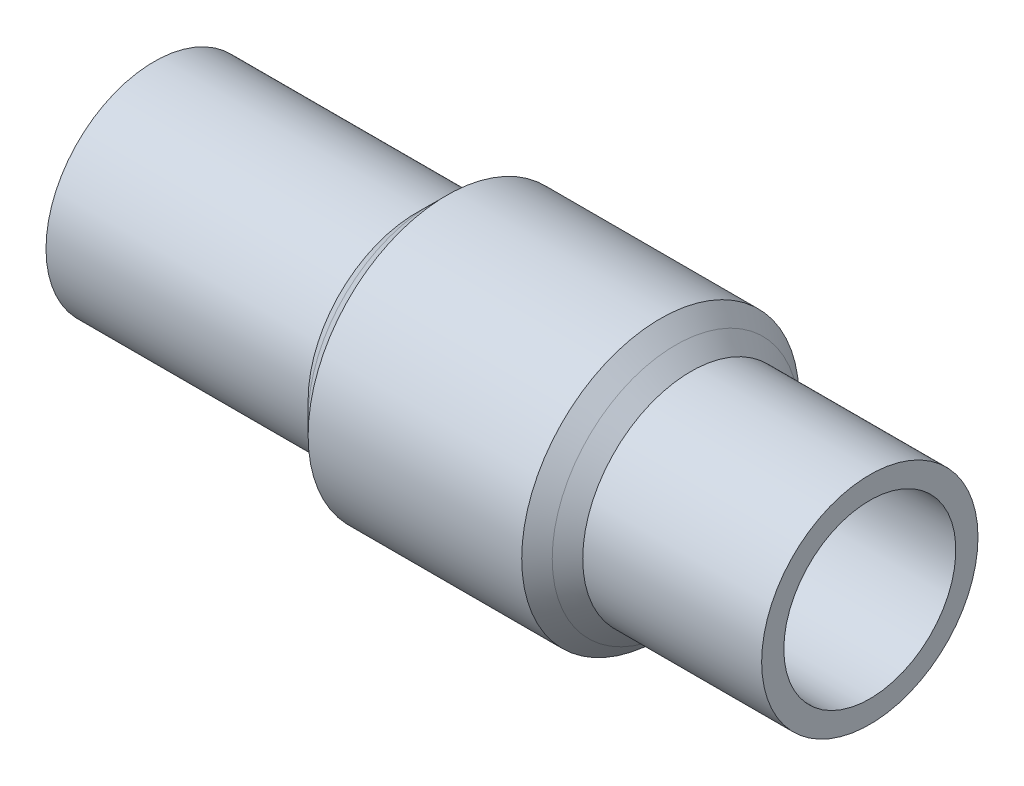
ISO-10303-21;
HEADER;
FILE_DESCRIPTION(('STEP AP214'),'2;1');
FILE_NAME('part.step','',(''),(''),'','','');
FILE_SCHEMA(('AUTOMOTIVE_DESIGN { 1 0 10303 214 1 1 1 1 }'));
ENDSEC;
DATA;
#1=APPLICATION_CONTEXT('core data for automotive mechanical design processes');
#2=APPLICATION_PROTOCOL_DEFINITION('international standard','automotive_design',2000,#1);
#3=PRODUCT_CONTEXT('',#1,'mechanical');
#4=PRODUCT('Part','Part','',(#3));
#5=PRODUCT_RELATED_PRODUCT_CATEGORY('part','',(#4));
#6=PRODUCT_DEFINITION_FORMATION('','',#4);
#7=PRODUCT_DEFINITION_CONTEXT('part definition',#1,'design');
#8=PRODUCT_DEFINITION('design','',#6,#7);
#9=PRODUCT_DEFINITION_SHAPE('','',#8);
#10=(LENGTH_UNIT() NAMED_UNIT(*) SI_UNIT(.MILLI.,.METRE.));
#11=(NAMED_UNIT(*) PLANE_ANGLE_UNIT() SI_UNIT($,.RADIAN.));
#12=(NAMED_UNIT(*) SI_UNIT($,.STERADIAN.) SOLID_ANGLE_UNIT());
#13=UNCERTAINTY_MEASURE_WITH_UNIT(LENGTH_MEASURE(1.E-05),#10,'distance_accuracy_value','');
#14=(GEOMETRIC_REPRESENTATION_CONTEXT(3) GLOBAL_UNCERTAINTY_ASSIGNED_CONTEXT((#13)) GLOBAL_UNIT_ASSIGNED_CONTEXT((#10,
#11,#12)) REPRESENTATION_CONTEXT('',''));
#15=CARTESIAN_POINT('',(0.,0.,0.));
#16=DIRECTION('',(0.,0.,1.));
#17=DIRECTION('',(1.,0.,0.));
#18=AXIS2_PLACEMENT_3D('',#15,#16,#17);
#19=CARTESIAN_POINT('',(-11.4,0.,0.));
#20=DIRECTION('',(-1.,0.,0.));
#21=DIRECTION('',(0.,0.,1.));
#22=AXIS2_PLACEMENT_3D('',#19,#20,#21);
#23=CYLINDRICAL_SURFACE('',#22,3.9);
#24=CARTESIAN_POINT('',(-4.95000000000001,0.,0.));
#25=DIRECTION('',(1.,0.,0.));
#26=DIRECTION('',(0.,0.,-1.));
#27=AXIS2_PLACEMENT_3D('',#24,#25,#26);
#28=CIRCLE('',#27,3.9);
#29=CARTESIAN_POINT('',(-4.95000000000001,0.,3.9));
#30=VERTEX_POINT('',#29);
#31=EDGE_CURVE('E56',#30,#30,#28,.F.);
#32=CARTESIAN_POINT('',(-14.4,0.,0.));
#33=DIRECTION('',(-1.,0.,0.));
#34=DIRECTION('',(0.,0.,1.));
#35=AXIS2_PLACEMENT_3D('',#32,#33,#34);
#36=CIRCLE('',#35,3.9);
#37=CARTESIAN_POINT('',(-14.4,0.,3.9));
#38=VERTEX_POINT('',#37);
#39=EDGE_CURVE('E77',#38,#38,#36,.T.);
#40=CARTESIAN_POINT('',(-4.95000000000001,0.,3.9));
#41=CARTESIAN_POINT('',(-5.04843750000001,0.,3.9));
#42=CARTESIAN_POINT('',(-5.14687500000001,0.,3.9));
#43=CARTESIAN_POINT('',(-5.34375000000001,0.,3.9));
#44=CARTESIAN_POINT('',(-5.44218750000001,0.,3.9));
#45=CARTESIAN_POINT('',(-5.63906250000001,0.,3.9));
#46=CARTESIAN_POINT('',(-5.73750000000001,0.,3.9));
#47=CARTESIAN_POINT('',(-5.93437500000001,0.,3.9));
#48=CARTESIAN_POINT('',(-6.03281250000001,0.,3.9));
#49=CARTESIAN_POINT('',(-6.22968750000001,0.,3.9));
#50=CARTESIAN_POINT('',(-6.32812500000001,0.,3.9));
#51=CARTESIAN_POINT('',(-6.52500000000001,0.,3.9));
#52=CARTESIAN_POINT('',(-6.62343750000001,0.,3.9));
#53=CARTESIAN_POINT('',(-6.82031250000001,0.,3.9));
#54=CARTESIAN_POINT('',(-6.91875000000001,0.,3.9));
#55=CARTESIAN_POINT('',(-7.11562500000001,0.,3.9));
#56=CARTESIAN_POINT('',(-7.21406250000001,0.,3.9));
#57=CARTESIAN_POINT('',(-7.41093750000001,0.,3.9));
#58=CARTESIAN_POINT('',(-7.50937500000001,0.,3.9));
#59=CARTESIAN_POINT('',(-7.70625000000001,0.,3.9));
#60=CARTESIAN_POINT('',(-7.80468750000001,0.,3.9));
#61=CARTESIAN_POINT('',(-8.00156250000001,0.,3.9));
#62=CARTESIAN_POINT('',(-8.10000000000001,0.,3.9));
#63=CARTESIAN_POINT('',(-8.29687500000001,0.,3.9));
#64=CARTESIAN_POINT('',(-8.39531250000001,0.,3.9));
#65=CARTESIAN_POINT('',(-8.59218750000001,0.,3.9));
#66=CARTESIAN_POINT('',(-8.69062500000001,0.,3.9));
#67=CARTESIAN_POINT('',(-8.88750000000001,0.,3.9));
#68=CARTESIAN_POINT('',(-8.98593750000001,0.,3.9));
#69=CARTESIAN_POINT('',(-9.18281250000001,0.,3.9));
#70=CARTESIAN_POINT('',(-9.28125000000002,0.,3.9));
#71=CARTESIAN_POINT('',(-9.47812500000001,0.,3.9));
#72=CARTESIAN_POINT('',(-9.57656250000002,0.,3.9));
#73=CARTESIAN_POINT('',(-9.77343750000001,0.,3.9));
#74=CARTESIAN_POINT('',(-9.87187500000002,0.,3.9));
#75=CARTESIAN_POINT('',(-10.06875,0.,3.9));
#76=CARTESIAN_POINT('',(-10.1671875,0.,3.9));
#77=CARTESIAN_POINT('',(-10.3640625,0.,3.9));
#78=CARTESIAN_POINT('',(-10.4625,0.,3.9));
#79=CARTESIAN_POINT('',(-10.659375,0.,3.9));
#80=CARTESIAN_POINT('',(-10.7578125,0.,3.9));
#81=CARTESIAN_POINT('',(-10.9546875,0.,3.9));
#82=CARTESIAN_POINT('',(-11.053125,0.,3.9));
#83=CARTESIAN_POINT('',(-11.25,0.,3.9));
#84=CARTESIAN_POINT('',(-11.3484375,0.,3.9));
#85=CARTESIAN_POINT('',(-11.5453125,0.,3.9));
#86=CARTESIAN_POINT('',(-11.64375,0.,3.9));
#87=CARTESIAN_POINT('',(-11.840625,0.,3.9));
#88=CARTESIAN_POINT('',(-11.9390625,0.,3.9));
#89=CARTESIAN_POINT('',(-12.1359375,0.,3.9));
#90=CARTESIAN_POINT('',(-12.234375,0.,3.9));
#91=CARTESIAN_POINT('',(-12.43125,0.,3.9));
#92=CARTESIAN_POINT('',(-12.5296875,0.,3.9));
#93=CARTESIAN_POINT('',(-12.7265625,0.,3.9));
#94=CARTESIAN_POINT('',(-12.825,0.,3.9));
#95=CARTESIAN_POINT('',(-13.021875,0.,3.9));
#96=CARTESIAN_POINT('',(-13.1203125,0.,3.9));
#97=CARTESIAN_POINT('',(-13.3171875,0.,3.9));
#98=CARTESIAN_POINT('',(-13.415625,0.,3.9));
#99=CARTESIAN_POINT('',(-13.6125,0.,3.9));
#100=CARTESIAN_POINT('',(-13.7109375,0.,3.9));
#101=CARTESIAN_POINT('',(-13.9078125,0.,3.9));
#102=CARTESIAN_POINT('',(-14.00625,0.,3.9));
#103=CARTESIAN_POINT('',(-14.203125,0.,3.9));
#104=CARTESIAN_POINT('',(-14.3015625,0.,3.9));
#105=CARTESIAN_POINT('',(-14.4,0.,3.9));
#106=B_SPLINE_CURVE_WITH_KNOTS('',3,(#40,#41,#42,#43,#44,#45,#46,#47,#48,#49,#50,#51,#52,#53,
#54,#55,#56,#57,#58,#59,#60,#61,#62,#63,#64,#65,#66,#67,#68,#69,#70,#71,#72,#73,#74,#75,#76,#77,
#78,#79,#80,#81,#82,#83,#84,#85,#86,#87,#88,#89,#90,#91,#92,#93,#94,#95,#96,#97,#98,#99,#100,
#101,#102,#103,#104,#105),.UNSPECIFIED.,.F.,.F.,(4,2,2,2,2,2,2,2,2,2,2,2,2,2,2,2,2,2,2,2,2,2,2,
2,2,2,2,2,2,2,2,2,4),(0.,0.2953125,0.590625000000001,0.885937500000001,1.18125,1.4765625,
1.771875,2.0671875,2.3625,2.6578125,2.953125,3.2484375,3.54375,3.8390625,4.134375,
4.42968750000001,4.72500000000001,5.02031250000001,5.31562500000001,5.61093750000001,
5.90625000000001,6.20156250000001,6.49687500000001,6.79218750000001,7.08750000000001,
7.38281250000001,7.67812500000001,7.97343750000001,8.26875000000001,8.56406250000001,
8.85937500000001,9.15468750000001,9.45000000000001),.UNSPECIFIED.);
#107=EDGE_CURVE('BSEAM48',#30,#38,#106,.T.);
#108=ORIENTED_EDGE('',*,*,#31,.T.);
#109=ORIENTED_EDGE('',*,*,#39,.F.);
#110=ORIENTED_EDGE('',*,*,#107,.T.);
#111=ORIENTED_EDGE('',*,*,#107,.F.);
#112=EDGE_LOOP('',(#108,#110,#109,#111));
#113=FACE_BOUND('',#112,.T.);
#114=ADVANCED_FACE('F48',(#113),#23,.T.);
#115=CARTESIAN_POINT('',(-11.4,0.,0.));
#116=DIRECTION('',(-1.,0.,0.));
#117=DIRECTION('',(0.,0.,1.));
#118=AXIS2_PLACEMENT_3D('',#115,#116,#117);
#119=CYLINDRICAL_SURFACE('',#118,5.);
#120=CARTESIAN_POINT('',(-3.85000000000002,0.,0.));
#121=DIRECTION('',(1.,0.,0.));
#122=DIRECTION('',(0.,0.,-1.));
#123=AXIS2_PLACEMENT_3D('',#120,#121,#122);
#124=CIRCLE('',#123,5.);
#125=CARTESIAN_POINT('',(-3.85000000000002,0.,5.));
#126=VERTEX_POINT('',#125);
#127=EDGE_CURVE('E61',#126,#126,#124,.T.);
#128=CARTESIAN_POINT('',(3.84999999999996,0.,0.));
#129=DIRECTION('',(-1.,0.,0.));
#130=DIRECTION('',(0.,0.,1.));
#131=AXIS2_PLACEMENT_3D('',#128,#129,#130);
#132=CIRCLE('',#131,5.);
#133=CARTESIAN_POINT('',(3.84999999999997,0.,5.));
#134=VERTEX_POINT('',#133);
#135=EDGE_CURVE('E86',#134,#134,#132,.T.);
#136=CARTESIAN_POINT('',(-3.85000000000002,0.,5.));
#137=CARTESIAN_POINT('',(-3.76979166666669,0.,5.));
#138=CARTESIAN_POINT('',(-3.68958333333335,0.,5.));
#139=CARTESIAN_POINT('',(-3.52916666666669,0.,5.));
#140=CARTESIAN_POINT('',(-3.44895833333335,0.,5.));
#141=CARTESIAN_POINT('',(-3.28854166666669,0.,5.));
#142=CARTESIAN_POINT('',(-3.20833333333335,0.,5.));
#143=CARTESIAN_POINT('',(-3.04791666666669,0.,5.));
#144=CARTESIAN_POINT('',(-2.96770833333336,0.,5.));
#145=CARTESIAN_POINT('',(-2.80729166666669,0.,5.));
#146=CARTESIAN_POINT('',(-2.72708333333336,0.,5.));
#147=CARTESIAN_POINT('',(-2.56666666666669,0.,5.));
#148=CARTESIAN_POINT('',(-2.48645833333336,0.,5.));
#149=CARTESIAN_POINT('',(-2.32604166666669,0.,5.));
#150=CARTESIAN_POINT('',(-2.24583333333336,0.,5.));
#151=CARTESIAN_POINT('',(-2.08541666666669,0.,5.));
#152=CARTESIAN_POINT('',(-2.00520833333336,0.,5.));
#153=CARTESIAN_POINT('',(-1.84479166666669,0.,5.));
#154=CARTESIAN_POINT('',(-1.76458333333336,0.,5.));
#155=CARTESIAN_POINT('',(-1.60416666666669,0.,5.));
#156=CARTESIAN_POINT('',(-1.52395833333336,0.,5.));
#157=CARTESIAN_POINT('',(-1.36354166666669,0.,5.));
#158=CARTESIAN_POINT('',(-1.28333333333336,0.,5.));
#159=CARTESIAN_POINT('',(-1.12291666666669,0.,5.));
#160=CARTESIAN_POINT('',(-1.04270833333336,0.,5.));
#161=CARTESIAN_POINT('',(-0.882291666666691,0.,5.));
#162=CARTESIAN_POINT('',(-0.802083333333359,0.,5.));
#163=CARTESIAN_POINT('',(-0.641666666666693,0.,5.));
#164=CARTESIAN_POINT('',(-0.561458333333359,0.,5.));
#165=CARTESIAN_POINT('',(-0.401041666666692,0.,5.));
#166=CARTESIAN_POINT('',(-0.32083333333336,0.,5.));
#167=CARTESIAN_POINT('',(-0.160416666666694,0.,5.));
#168=CARTESIAN_POINT('',(-0.0802083333333598,0.,5.));
#169=CARTESIAN_POINT('',(0.0802083333333066,0.,5.));
#170=CARTESIAN_POINT('',(0.160416666666639,0.,5.));
#171=CARTESIAN_POINT('',(0.320833333333305,0.,5.));
#172=CARTESIAN_POINT('',(0.401041666666639,0.,5.));
#173=CARTESIAN_POINT('',(0.561458333333306,0.,5.));
#174=CARTESIAN_POINT('',(0.641666666666638,0.,5.));
#175=CARTESIAN_POINT('',(0.802083333333305,0.,5.));
#176=CARTESIAN_POINT('',(0.882291666666638,0.,5.));
#177=CARTESIAN_POINT('',(1.0427083333333,0.,5.));
#178=CARTESIAN_POINT('',(1.12291666666664,0.,5.));
#179=CARTESIAN_POINT('',(1.2833333333333,0.,5.));
#180=CARTESIAN_POINT('',(1.36354166666664,0.,5.));
#181=CARTESIAN_POINT('',(1.5239583333333,0.,5.));
#182=CARTESIAN_POINT('',(1.60416666666664,0.,5.));
#183=CARTESIAN_POINT('',(1.7645833333333,0.,5.));
#184=CARTESIAN_POINT('',(1.84479166666664,0.,5.));
#185=CARTESIAN_POINT('',(2.0052083333333,0.,5.));
#186=CARTESIAN_POINT('',(2.08541666666664,0.,5.));
#187=CARTESIAN_POINT('',(2.2458333333333,0.,5.));
#188=CARTESIAN_POINT('',(2.32604166666664,0.,5.));
#189=CARTESIAN_POINT('',(2.4864583333333,0.,5.));
#190=CARTESIAN_POINT('',(2.56666666666664,0.,5.));
#191=CARTESIAN_POINT('',(2.7270833333333,0.,5.));
#192=CARTESIAN_POINT('',(2.80729166666663,0.,5.));
#193=CARTESIAN_POINT('',(2.9677083333333,0.,5.));
#194=CARTESIAN_POINT('',(3.04791666666663,0.,5.));
#195=CARTESIAN_POINT('',(3.2083333333333,0.,5.));
#196=CARTESIAN_POINT('',(3.28854166666663,0.,5.));
#197=CARTESIAN_POINT('',(3.4489583333333,0.,5.));
#198=CARTESIAN_POINT('',(3.52916666666663,0.,5.));
#199=CARTESIAN_POINT('',(3.6895833333333,0.,5.));
#200=CARTESIAN_POINT('',(3.76979166666663,0.,5.));
#201=CARTESIAN_POINT('',(3.84999999999997,0.,5.));
#202=B_SPLINE_CURVE_WITH_KNOTS('',3,(#136,#137,#138,#139,#140,#141,#142,#143,#144,#145,#146,
#147,#148,#149,#150,#151,#152,#153,#154,#155,#156,#157,#158,#159,#160,#161,#162,#163,#164,#165,
#166,#167,#168,#169,#170,#171,#172,#173,#174,#175,#176,#177,#178,#179,#180,#181,#182,#183,#184,
#185,#186,#187,#188,#189,#190,#191,#192,#193,#194,#195,#196,#197,#198,#199,#200,#201),
.UNSPECIFIED.,.F.,.F.,(4,2,2,2,2,2,2,2,2,2,2,2,2,2,2,2,2,2,2,2,2,2,2,2,2,2,2,2,2,2,2,2,4),(0.,
0.240625,0.481249999999998,0.721874999999998,0.962499999999997,1.203125,1.44375,1.684375,1.925,
2.165625,2.40624999999999,2.64687499999999,2.8875,3.12812499999999,3.36874999999999,
3.60937499999999,3.84999999999999,4.09062499999999,4.33124999999999,4.57187499999999,
4.81249999999999,5.05312499999999,5.29374999999999,5.53437499999999,5.77499999999999,
6.01562499999999,6.25624999999999,6.49687499999999,6.73749999999999,6.97812499999999,
7.21874999999999,7.45937499999999,7.69999999999999),.UNSPECIFIED.);
#203=EDGE_CURVE('BSEAM91',#126,#134,#202,.T.);
#204=ORIENTED_EDGE('',*,*,#127,.T.);
#205=ORIENTED_EDGE('',*,*,#135,.T.);
#206=ORIENTED_EDGE('',*,*,#203,.T.);
#207=ORIENTED_EDGE('',*,*,#203,.F.);
#208=EDGE_LOOP('',(#204,#206,#205,#207));
#209=FACE_BOUND('',#208,.T.);
#210=ADVANCED_FACE('F91',(#209),#119,.T.);
#211=CARTESIAN_POINT('',(-11.4,0.,0.));
#212=DIRECTION('',(-1.,0.,0.));
#213=DIRECTION('',(0.,0.,1.));
#214=AXIS2_PLACEMENT_3D('',#211,#212,#213);
#215=CYLINDRICAL_SURFACE('',#214,3.9);
#216=CARTESIAN_POINT('',(4.94999999999998,0.,0.));
#217=DIRECTION('',(-1.,0.,0.));
#218=DIRECTION('',(0.,0.,1.));
#219=AXIS2_PLACEMENT_3D('',#216,#217,#218);
#220=CIRCLE('',#219,3.9);
#221=CARTESIAN_POINT('',(4.94999999999999,0.,3.9));
#222=VERTEX_POINT('',#221);
#223=EDGE_CURVE('E12',#222,#222,#220,.F.);
#224=CARTESIAN_POINT('',(11.4,0.,0.));
#225=DIRECTION('',(-1.,0.,0.));
#226=DIRECTION('',(0.,0.,1.));
#227=AXIS2_PLACEMENT_3D('',#224,#225,#226);
#228=CIRCLE('',#227,3.9);
#229=CARTESIAN_POINT('',(11.4,0.,3.9));
#230=VERTEX_POINT('',#229);
#231=EDGE_CURVE('E70',#230,#230,#228,.T.);
#232=CARTESIAN_POINT('',(4.94999999999999,0.,3.9));
#233=CARTESIAN_POINT('',(5.01718749999999,0.,3.9));
#234=CARTESIAN_POINT('',(5.08437499999998,0.,3.9));
#235=CARTESIAN_POINT('',(5.21874999999998,0.,3.9));
#236=CARTESIAN_POINT('',(5.28593749999998,0.,3.9));
#237=CARTESIAN_POINT('',(5.42031249999998,0.,3.9));
#238=CARTESIAN_POINT('',(5.48749999999998,0.,3.9));
#239=CARTESIAN_POINT('',(5.62187499999998,0.,3.9));
#240=CARTESIAN_POINT('',(5.68906249999998,0.,3.9));
#241=CARTESIAN_POINT('',(5.82343749999998,0.,3.9));
#242=CARTESIAN_POINT('',(5.89062499999998,0.,3.9));
#243=CARTESIAN_POINT('',(6.02499999999998,0.,3.9));
#244=CARTESIAN_POINT('',(6.09218749999998,0.,3.9));
#245=CARTESIAN_POINT('',(6.22656249999998,0.,3.9));
#246=CARTESIAN_POINT('',(6.29374999999998,0.,3.9));
#247=CARTESIAN_POINT('',(6.42812499999998,0.,3.9));
#248=CARTESIAN_POINT('',(6.49531249999998,0.,3.9));
#249=CARTESIAN_POINT('',(6.62968749999998,0.,3.9));
#250=CARTESIAN_POINT('',(6.69687499999998,0.,3.9));
#251=CARTESIAN_POINT('',(6.83124999999998,0.,3.9));
#252=CARTESIAN_POINT('',(6.89843749999998,0.,3.9));
#253=CARTESIAN_POINT('',(7.03281249999998,0.,3.9));
#254=CARTESIAN_POINT('',(7.09999999999998,0.,3.9));
#255=CARTESIAN_POINT('',(7.23437499999998,0.,3.9));
#256=CARTESIAN_POINT('',(7.30156249999998,0.,3.9));
#257=CARTESIAN_POINT('',(7.43593749999998,0.,3.9));
#258=CARTESIAN_POINT('',(7.50312499999998,0.,3.9));
#259=CARTESIAN_POINT('',(7.63749999999998,0.,3.9));
#260=CARTESIAN_POINT('',(7.70468749999998,0.,3.9));
#261=CARTESIAN_POINT('',(7.83906249999998,0.,3.9));
#262=CARTESIAN_POINT('',(7.90624999999998,0.,3.9));
#263=CARTESIAN_POINT('',(8.04062499999998,0.,3.9));
#264=CARTESIAN_POINT('',(8.10781249999998,0.,3.9));
#265=CARTESIAN_POINT('',(8.24218749999998,0.,3.9));
#266=CARTESIAN_POINT('',(8.30937499999998,0.,3.9));
#267=CARTESIAN_POINT('',(8.44374999999997,0.,3.9));
#268=CARTESIAN_POINT('',(8.51093749999998,0.,3.9));
#269=CARTESIAN_POINT('',(8.64531249999998,0.,3.9));
#270=CARTESIAN_POINT('',(8.71249999999998,0.,3.9));
#271=CARTESIAN_POINT('',(8.84687499999998,0.,3.9));
#272=CARTESIAN_POINT('',(8.91406249999998,0.,3.9));
#273=CARTESIAN_POINT('',(9.04843749999998,0.,3.9));
#274=CARTESIAN_POINT('',(9.11562499999997,0.,3.9));
#275=CARTESIAN_POINT('',(9.24999999999998,0.,3.9));
#276=CARTESIAN_POINT('',(9.31718749999997,0.,3.9));
#277=CARTESIAN_POINT('',(9.45156249999997,0.,3.9));
#278=CARTESIAN_POINT('',(9.51874999999998,0.,3.9));
#279=CARTESIAN_POINT('',(9.65312499999997,0.,3.9));
#280=CARTESIAN_POINT('',(9.72031249999997,0.,3.9));
#281=CARTESIAN_POINT('',(9.85468749999997,0.,3.9));
#282=CARTESIAN_POINT('',(9.92187499999997,0.,3.9));
#283=CARTESIAN_POINT('',(10.05625,0.,3.9));
#284=CARTESIAN_POINT('',(10.1234375,0.,3.9));
#285=CARTESIAN_POINT('',(10.2578125,0.,3.9));
#286=CARTESIAN_POINT('',(10.325,0.,3.9));
#287=CARTESIAN_POINT('',(10.459375,0.,3.9));
#288=CARTESIAN_POINT('',(10.5265625,0.,3.9));
#289=CARTESIAN_POINT('',(10.6609375,0.,3.9));
#290=CARTESIAN_POINT('',(10.728125,0.,3.9));
#291=CARTESIAN_POINT('',(10.8625,0.,3.9));
#292=CARTESIAN_POINT('',(10.9296875,0.,3.9));
#293=CARTESIAN_POINT('',(11.0640625,0.,3.9));
#294=CARTESIAN_POINT('',(11.13125,0.,3.9));
#295=CARTESIAN_POINT('',(11.265625,0.,3.9));
#296=CARTESIAN_POINT('',(11.3328125,0.,3.9));
#297=CARTESIAN_POINT('',(11.4,0.,3.9));
#298=B_SPLINE_CURVE_WITH_KNOTS('',3,(#232,#233,#234,#235,#236,#237,#238,#239,#240,#241,#242,
#243,#244,#245,#246,#247,#248,#249,#250,#251,#252,#253,#254,#255,#256,#257,#258,#259,#260,#261,
#262,#263,#264,#265,#266,#267,#268,#269,#270,#271,#272,#273,#274,#275,#276,#277,#278,#279,#280,
#281,#282,#283,#284,#285,#286,#287,#288,#289,#290,#291,#292,#293,#294,#295,#296,#297),
.UNSPECIFIED.,.F.,.F.,(4,2,2,2,2,2,2,2,2,2,2,2,2,2,2,2,2,2,2,2,2,2,2,2,2,2,2,2,2,2,2,2,4),(0.,
0.201562499999999,0.403124999999997,0.604687499999999,0.806249999999998,1.0078125,1.209375,
1.4109375,1.6125,1.81406249999999,2.01562499999999,2.2171875,2.41874999999999,2.62031249999999,
2.82187499999999,3.02343749999999,3.22499999999999,3.42656249999999,3.62812499999999,
3.82968749999999,4.03124999999999,4.23281249999999,4.43437499999999,4.63593749999999,
4.83749999999999,5.03906249999999,5.24062499999998,5.44218749999999,5.64374999999999,
5.84531249999998,6.04687499999999,6.24843749999998,6.44999999999998),.UNSPECIFIED.);
#299=EDGE_CURVE('BSEAM113',#222,#230,#298,.T.);
#300=ORIENTED_EDGE('',*,*,#223,.T.);
#301=ORIENTED_EDGE('',*,*,#231,.T.);
#302=ORIENTED_EDGE('',*,*,#299,.T.);
#303=ORIENTED_EDGE('',*,*,#299,.F.);
#304=EDGE_LOOP('',(#300,#302,#301,#303));
#305=FACE_BOUND('',#304,.T.);
#306=ADVANCED_FACE('F113',(#305),#215,.T.);
#307=CARTESIAN_POINT('',(11.4,0.,-3.9));
#308=DIRECTION('',(-1.,0.,0.));
#309=DIRECTION('',(0.,0.,1.));
#310=AXIS2_PLACEMENT_3D('',#307,#308,#309);
#311=PLANE('',#310);
#312=ORIENTED_EDGE('',*,*,#231,.F.);
#313=EDGE_LOOP('',(#312));
#314=FACE_BOUND('',#313,.T.);
#315=CARTESIAN_POINT('',(11.4,0.,0.));
#316=DIRECTION('',(-1.,0.,0.));
#317=DIRECTION('',(0.,0.,1.));
#318=AXIS2_PLACEMENT_3D('',#315,#316,#317);
#319=CIRCLE('',#318,3.1);
#320=CARTESIAN_POINT('',(11.4,0.,3.1));
#321=VERTEX_POINT('',#320);
#322=EDGE_CURVE('E66',#321,#321,#319,.T.);
#323=ORIENTED_EDGE('',*,*,#322,.T.);
#324=EDGE_LOOP('',(#323));
#325=FACE_BOUND('',#324,.T.);
#326=ADVANCED_FACE('F119',(#314,#325),#311,.F.);
#327=CARTESIAN_POINT('',(-11.4,0.,0.));
#328=DIRECTION('',(-1.,0.,0.));
#329=DIRECTION('',(0.,0.,1.));
#330=AXIS2_PLACEMENT_3D('',#327,#328,#329);
#331=CYLINDRICAL_SURFACE('',#330,3.1);
#332=CARTESIAN_POINT('',(-11.4,0.,0.));
#333=DIRECTION('',(-1.,0.,0.));
#334=DIRECTION('',(0.,0.,1.));
#335=AXIS2_PLACEMENT_3D('',#332,#333,#334);
#336=CIRCLE('',#335,3.1);
#337=CARTESIAN_POINT('',(-11.4,0.,3.1));
#338=VERTEX_POINT('',#337);
#339=EDGE_CURVE('E73',#338,#338,#336,.T.);
#340=CARTESIAN_POINT('',(11.4,0.,3.1));
#341=CARTESIAN_POINT('',(11.1625,0.,3.1));
#342=CARTESIAN_POINT('',(10.925,0.,3.1));
#343=CARTESIAN_POINT('',(10.45,0.,3.1));
#344=CARTESIAN_POINT('',(10.2125,0.,3.1));
#345=CARTESIAN_POINT('',(9.73749999999997,0.,3.1));
#346=CARTESIAN_POINT('',(9.49999999999997,0.,3.1));
#347=CARTESIAN_POINT('',(9.02499999999997,0.,3.1));
#348=CARTESIAN_POINT('',(8.78749999999997,0.,3.1));
#349=CARTESIAN_POINT('',(8.31249999999997,0.,3.1));
#350=CARTESIAN_POINT('',(8.07499999999997,0.,3.1));
#351=CARTESIAN_POINT('',(7.59999999999997,0.,3.1));
#352=CARTESIAN_POINT('',(7.36249999999997,0.,3.1));
#353=CARTESIAN_POINT('',(6.88749999999997,0.,3.1));
#354=CARTESIAN_POINT('',(6.64999999999997,0.,3.1));
#355=CARTESIAN_POINT('',(6.17499999999997,0.,3.1));
#356=CARTESIAN_POINT('',(5.93749999999997,0.,3.1));
#357=CARTESIAN_POINT('',(5.46249999999997,0.,3.1));
#358=CARTESIAN_POINT('',(5.22499999999997,0.,3.1));
#359=CARTESIAN_POINT('',(4.74999999999997,0.,3.1));
#360=CARTESIAN_POINT('',(4.51249999999997,0.,3.1));
#361=CARTESIAN_POINT('',(4.03749999999997,0.,3.1));
#362=CARTESIAN_POINT('',(3.79999999999997,0.,3.1));
#363=CARTESIAN_POINT('',(3.32499999999997,0.,3.1));
#364=CARTESIAN_POINT('',(3.08749999999997,0.,3.1));
#365=CARTESIAN_POINT('',(2.61249999999997,0.,3.1));
#366=CARTESIAN_POINT('',(2.37499999999997,0.,3.1));
#367=CARTESIAN_POINT('',(1.89999999999997,0.,3.1));
#368=CARTESIAN_POINT('',(1.66249999999997,0.,3.1));
#369=CARTESIAN_POINT('',(1.18749999999997,0.,3.1));
#370=CARTESIAN_POINT('',(0.949999999999973,0.,3.1));
#371=CARTESIAN_POINT('',(0.474999999999974,0.,3.1));
#372=CARTESIAN_POINT('',(0.237499999999974,0.,3.1));
#373=CARTESIAN_POINT('',(-0.237500000000026,0.,3.1));
#374=CARTESIAN_POINT('',(-0.475000000000026,0.,3.1));
#375=CARTESIAN_POINT('',(-0.950000000000025,0.,3.1));
#376=CARTESIAN_POINT('',(-1.18750000000003,0.,3.1));
#377=CARTESIAN_POINT('',(-1.66250000000002,0.,3.1));
#378=CARTESIAN_POINT('',(-1.90000000000003,0.,3.1));
#379=CARTESIAN_POINT('',(-2.37500000000002,0.,3.1));
#380=CARTESIAN_POINT('',(-2.61250000000002,0.,3.1));
#381=CARTESIAN_POINT('',(-3.08750000000002,0.,3.1));
#382=CARTESIAN_POINT('',(-3.32500000000003,0.,3.1));
#383=CARTESIAN_POINT('',(-3.80000000000002,0.,3.1));
#384=CARTESIAN_POINT('',(-4.03750000000002,0.,3.1));
#385=CARTESIAN_POINT('',(-4.51250000000002,0.,3.1));
#386=CARTESIAN_POINT('',(-4.75000000000002,0.,3.1));
#387=CARTESIAN_POINT('',(-5.22500000000002,0.,3.1));
#388=CARTESIAN_POINT('',(-5.46250000000002,0.,3.1));
#389=CARTESIAN_POINT('',(-5.93750000000002,0.,3.1));
#390=CARTESIAN_POINT('',(-6.17500000000002,0.,3.1));
#391=CARTESIAN_POINT('',(-6.65000000000002,0.,3.1));
#392=CARTESIAN_POINT('',(-6.88750000000002,0.,3.1));
#393=CARTESIAN_POINT('',(-7.36250000000002,0.,3.1));
#394=CARTESIAN_POINT('',(-7.60000000000002,0.,3.1));
#395=CARTESIAN_POINT('',(-8.07500000000002,0.,3.1));
#396=CARTESIAN_POINT('',(-8.31250000000002,0.,3.1));
#397=CARTESIAN_POINT('',(-8.78750000000002,0.,3.1));
#398=CARTESIAN_POINT('',(-9.02500000000002,0.,3.1));
#399=CARTESIAN_POINT('',(-9.50000000000002,0.,3.1));
#400=CARTESIAN_POINT('',(-9.73750000000002,0.,3.1));
#401=CARTESIAN_POINT('',(-10.2125,0.,3.1));
#402=CARTESIAN_POINT('',(-10.45,0.,3.1));
#403=CARTESIAN_POINT('',(-10.925,0.,3.1));
#404=CARTESIAN_POINT('',(-11.1625,0.,3.1));
#405=CARTESIAN_POINT('',(-11.4,0.,3.1));
#406=B_SPLINE_CURVE_WITH_KNOTS('',3,(#340,#341,#342,#343,#344,#345,#346,#347,#348,#349,#350,
#351,#352,#353,#354,#355,#356,#357,#358,#359,#360,#361,#362,#363,#364,#365,#366,#367,#368,#369,
#370,#371,#372,#373,#374,#375,#376,#377,#378,#379,#380,#381,#382,#383,#384,#385,#386,#387,#388,
#389,#390,#391,#392,#393,#394,#395,#396,#397,#398,#399,#400,#401,#402,#403,#404,#405),
.UNSPECIFIED.,.F.,.F.,(4,2,2,2,2,2,2,2,2,2,2,2,2,2,2,2,2,2,2,2,2,2,2,2,2,2,2,2,2,2,2,2,4),(0.,
0.712500000000001,1.425,2.1375,2.85,3.5625,4.275,4.9875,5.7,6.4125,7.125,7.8375,8.55,9.2625,
9.975,10.6875,11.4,12.1125,12.825,13.5375,14.25,14.9625,15.675,16.3875,17.1,17.8125,18.525,
19.2375,19.95,20.6625,21.375,22.0875,22.8),.UNSPECIFIED.);
#407=EDGE_CURVE('BSEAM104',#321,#338,#406,.T.);
#408=ORIENTED_EDGE('',*,*,#322,.F.);
#409=ORIENTED_EDGE('',*,*,#339,.T.);
#410=ORIENTED_EDGE('',*,*,#407,.T.);
#411=ORIENTED_EDGE('',*,*,#407,.F.);
#412=EDGE_LOOP('',(#408,#410,#409,#411));
#413=FACE_BOUND('',#412,.T.);
#414=ADVANCED_FACE('F104',(#413),#331,.F.);
#415=CARTESIAN_POINT('',(-4.95000000000001,0.,0.));
#416=DIRECTION('',(1.,0.,0.));
#417=DIRECTION('',(0.,0.,-1.));
#418=AXIS2_PLACEMENT_3D('',#415,#416,#417);
#419=CONICAL_SURFACE('',#418,3.9,0.785398163397442);
#420=ORIENTED_EDGE('',*,*,#31,.F.);
#421=EDGE_LOOP('',(#420));
#422=FACE_BOUND('',#421,.T.);
#423=CARTESIAN_POINT('',(-4.40000000000001,0.,0.));
#424=DIRECTION('',(1.,0.,0.));
#425=DIRECTION('',(0.,0.,-1.));
#426=AXIS2_PLACEMENT_3D('',#423,#424,#425);
#427=CIRCLE('',#426,4.45);
#428=CARTESIAN_POINT('',(-4.40000000000001,0.,-4.45));
#429=VERTEX_POINT('',#428);
#430=EDGE_CURVE('E64',#429,#429,#427,.T.);
#431=ORIENTED_EDGE('',*,*,#430,.F.);
#432=EDGE_LOOP('',(#431));
#433=FACE_BOUND('',#432,.T.);
#434=ADVANCED_FACE('F96',(#422,#433),#419,.T.);
#435=CARTESIAN_POINT('',(-4.40000000000001,0.,0.));
#436=DIRECTION('',(1.,0.,0.));
#437=DIRECTION('',(0.,0.,-1.));
#438=AXIS2_PLACEMENT_3D('',#435,#436,#437);
#439=CONICAL_SURFACE('',#438,4.44999999999999,0.785398163397448);
#440=ORIENTED_EDGE('',*,*,#127,.F.);
#441=EDGE_LOOP('',(#440));
#442=FACE_BOUND('',#441,.T.);
#443=ORIENTED_EDGE('',*,*,#430,.T.);
#444=EDGE_LOOP('',(#443));
#445=FACE_BOUND('',#444,.T.);
#446=ADVANCED_FACE('F94',(#442,#445),#439,.T.);
#447=CARTESIAN_POINT('',(4.39999999999999,0.,0.));
#448=DIRECTION('',(-1.,0.,0.));
#449=DIRECTION('',(0.,0.,1.));
#450=AXIS2_PLACEMENT_3D('',#447,#448,#449);
#451=CONICAL_SURFACE('',#450,4.45,0.785398163397455);
#452=CARTESIAN_POINT('',(4.39999999999999,0.,0.));
#453=DIRECTION('',(-1.,0.,0.));
#454=DIRECTION('',(0.,0.,1.));
#455=AXIS2_PLACEMENT_3D('',#452,#453,#454);
#456=CIRCLE('',#455,4.45);
#457=CARTESIAN_POINT('',(4.39999999999999,0.,4.45));
#458=VERTEX_POINT('',#457);
#459=EDGE_CURVE('E52',#458,#458,#456,.T.);
#460=CARTESIAN_POINT('',(4.94999999999998,0.,3.9));
#461=CARTESIAN_POINT('',(4.94427083333332,0.,3.90572916666666));
#462=CARTESIAN_POINT('',(4.93854166666665,0.,3.91145833333333));
#463=CARTESIAN_POINT('',(4.92708333333332,0.,3.92291666666666));
#464=CARTESIAN_POINT('',(4.92135416666665,0.,3.92864583333333));
#465=CARTESIAN_POINT('',(4.90989583333332,0.,3.94010416666666));
#466=CARTESIAN_POINT('',(4.90416666666665,0.,3.94583333333333));
#467=CARTESIAN_POINT('',(4.89270833333332,0.,3.95729166666666));
#468=CARTESIAN_POINT('',(4.88697916666665,0.,3.96302083333333));
#469=CARTESIAN_POINT('',(4.87552083333332,0.,3.97447916666666));
#470=CARTESIAN_POINT('',(4.86979166666665,0.,3.98020833333333));
#471=CARTESIAN_POINT('',(4.85833333333332,0.,3.99166666666666));
#472=CARTESIAN_POINT('',(4.85260416666665,0.,3.99739583333333));
#473=CARTESIAN_POINT('',(4.84114583333332,0.,4.00885416666666));
#474=CARTESIAN_POINT('',(4.83541666666665,0.,4.01458333333333));
#475=CARTESIAN_POINT('',(4.82395833333332,0.,4.02604166666667));
#476=CARTESIAN_POINT('',(4.81822916666665,0.,4.03177083333333));
#477=CARTESIAN_POINT('',(4.80677083333332,0.,4.04322916666667));
#478=CARTESIAN_POINT('',(4.80104166666665,0.,4.04895833333333));
#479=CARTESIAN_POINT('',(4.78958333333332,0.,4.06041666666667));
#480=CARTESIAN_POINT('',(4.78385416666665,0.,4.06614583333333));
#481=CARTESIAN_POINT('',(4.77239583333332,0.,4.07760416666667));
#482=CARTESIAN_POINT('',(4.76666666666665,0.,4.08333333333333));
#483=CARTESIAN_POINT('',(4.75520833333332,0.,4.09479166666666));
#484=CARTESIAN_POINT('',(4.74947916666665,0.,4.10052083333333));
#485=CARTESIAN_POINT('',(4.73802083333332,0.,4.11197916666667));
#486=CARTESIAN_POINT('',(4.73229166666665,0.,4.11770833333333));
#487=CARTESIAN_POINT('',(4.72083333333332,0.,4.12916666666667));
#488=CARTESIAN_POINT('',(4.71510416666665,0.,4.13489583333333));
#489=CARTESIAN_POINT('',(4.70364583333332,0.,4.14635416666667));
#490=CARTESIAN_POINT('',(4.69791666666665,0.,4.15208333333333));
#491=CARTESIAN_POINT('',(4.68645833333332,0.,4.16354166666667));
#492=CARTESIAN_POINT('',(4.68072916666665,0.,4.16927083333333));
#493=CARTESIAN_POINT('',(4.66927083333332,0.,4.18072916666667));
#494=CARTESIAN_POINT('',(4.66354166666665,0.,4.18645833333333));
#495=CARTESIAN_POINT('',(4.65208333333332,0.,4.19791666666667));
#496=CARTESIAN_POINT('',(4.64635416666665,0.,4.20364583333333));
#497=CARTESIAN_POINT('',(4.63489583333332,0.,4.21510416666667));
#498=CARTESIAN_POINT('',(4.62916666666665,0.,4.22083333333333));
#499=CARTESIAN_POINT('',(4.61770833333332,0.,4.23229166666667));
#500=CARTESIAN_POINT('',(4.61197916666665,0.,4.23802083333333));
#501=CARTESIAN_POINT('',(4.60052083333332,0.,4.24947916666667));
#502=CARTESIAN_POINT('',(4.59479166666665,0.,4.25520833333333));
#503=CARTESIAN_POINT('',(4.58333333333332,0.,4.26666666666667));
#504=CARTESIAN_POINT('',(4.57760416666665,0.,4.27239583333333));
#505=CARTESIAN_POINT('',(4.56614583333332,0.,4.28385416666667));
#506=CARTESIAN_POINT('',(4.56041666666665,0.,4.28958333333333));
#507=CARTESIAN_POINT('',(4.54895833333332,0.,4.30104166666667));
#508=CARTESIAN_POINT('',(4.54322916666665,0.,4.30677083333333));
#509=CARTESIAN_POINT('',(4.53177083333332,0.,4.31822916666667));
#510=CARTESIAN_POINT('',(4.52604166666665,0.,4.32395833333333));
#511=CARTESIAN_POINT('',(4.51458333333332,0.,4.33541666666667));
#512=CARTESIAN_POINT('',(4.50885416666665,0.,4.34114583333333));
#513=CARTESIAN_POINT('',(4.49739583333332,0.,4.35260416666667));
#514=CARTESIAN_POINT('',(4.49166666666665,0.,4.35833333333333));
#515=CARTESIAN_POINT('',(4.48020833333332,0.,4.36979166666667));
#516=CARTESIAN_POINT('',(4.47447916666665,0.,4.37552083333333));
#517=CARTESIAN_POINT('',(4.46302083333332,0.,4.38697916666667));
#518=CARTESIAN_POINT('',(4.45729166666665,0.,4.39270833333333));
#519=CARTESIAN_POINT('',(4.44583333333332,0.,4.40416666666667));
#520=CARTESIAN_POINT('',(4.44010416666665,0.,4.40989583333333));
#521=CARTESIAN_POINT('',(4.42864583333332,0.,4.42135416666667));
#522=CARTESIAN_POINT('',(4.42291666666665,0.,4.42708333333333));
#523=CARTESIAN_POINT('',(4.41145833333332,0.,4.43854166666667));
#524=CARTESIAN_POINT('',(4.40572916666665,0.,4.44427083333333));
#525=CARTESIAN_POINT('',(4.39999999999999,0.,4.45));
#526=B_SPLINE_CURVE_WITH_KNOTS('',3,(#460,#461,#462,#463,#464,#465,#466,#467,#468,#469,#470,
#471,#472,#473,#474,#475,#476,#477,#478,#479,#480,#481,#482,#483,#484,#485,#486,#487,#488,#489,
#490,#491,#492,#493,#494,#495,#496,#497,#498,#499,#500,#501,#502,#503,#504,#505,#506,#507,#508,
#509,#510,#511,#512,#513,#514,#515,#516,#517,#518,#519,#520,#521,#522,#523,#524,#525),
.UNSPECIFIED.,.F.,.F.,(4,2,2,2,2,2,2,2,2,2,2,2,2,2,2,2,2,2,2,2,2,2,2,2,2,2,2,2,2,2,2,2,4),(0.,
0.0243067956032873,0.0486135912065753,0.0729203868098627,0.09722718241315,0.121533978016438,
0.145840773619725,0.170147569223013,0.194454364826301,0.218761160429588,0.243067956032875,
0.267374751636163,0.291681547239451,0.315988342842738,0.340295138446025,0.364601934049313,
0.388908729652601,0.413215525255888,0.437522320859175,0.461829116462463,0.486135912065751,
0.510442707669038,0.534749503272326,0.559056298875613,0.583363094478901,0.607669890082188,
0.631976685685476,0.656283481288763,0.680590276892051,0.704897072495339,0.729203868098626,
0.753510663701914,0.777817459305201),.UNSPECIFIED.);
#527=EDGE_CURVE('BSEAM50',#222,#458,#526,.T.);
#528=ORIENTED_EDGE('',*,*,#223,.F.);
#529=ORIENTED_EDGE('',*,*,#459,.F.);
#530=ORIENTED_EDGE('',*,*,#527,.T.);
#531=ORIENTED_EDGE('',*,*,#527,.F.);
#532=EDGE_LOOP('',(#528,#530,#529,#531));
#533=FACE_BOUND('',#532,.T.);
#534=ADVANCED_FACE('F50',(#533),#451,.T.);
#535=CARTESIAN_POINT('',(3.84999999999996,0.,0.));
#536=DIRECTION('',(-1.,0.,0.));
#537=DIRECTION('',(0.,0.,1.));
#538=AXIS2_PLACEMENT_3D('',#535,#536,#537);
#539=CONICAL_SURFACE('',#538,5.,0.785398163397451);
#540=CARTESIAN_POINT('',(4.39999999999999,0.,4.44999999999998));
#541=CARTESIAN_POINT('',(4.39427083333332,0.,4.45572916666664));
#542=CARTESIAN_POINT('',(4.38854166666665,0.,4.46145833333331));
#543=CARTESIAN_POINT('',(4.37708333333332,0.,4.47291666666664));
#544=CARTESIAN_POINT('',(4.37135416666665,0.,4.47864583333331));
#545=CARTESIAN_POINT('',(4.35989583333332,0.,4.49010416666664));
#546=CARTESIAN_POINT('',(4.35416666666665,0.,4.49583333333331));
#547=CARTESIAN_POINT('',(4.34270833333332,0.,4.50729166666665));
#548=CARTESIAN_POINT('',(4.33697916666665,0.,4.51302083333331));
#549=CARTESIAN_POINT('',(4.32552083333332,0.,4.52447916666665));
#550=CARTESIAN_POINT('',(4.31979166666665,0.,4.53020833333331));
#551=CARTESIAN_POINT('',(4.30833333333332,0.,4.54166666666665));
#552=CARTESIAN_POINT('',(4.30260416666665,0.,4.54739583333331));
#553=CARTESIAN_POINT('',(4.29114583333332,0.,4.55885416666665));
#554=CARTESIAN_POINT('',(4.28541666666665,0.,4.56458333333331));
#555=CARTESIAN_POINT('',(4.27395833333332,0.,4.57604166666665));
#556=CARTESIAN_POINT('',(4.26822916666665,0.,4.58177083333331));
#557=CARTESIAN_POINT('',(4.25677083333332,0.,4.59322916666665));
#558=CARTESIAN_POINT('',(4.25104166666665,0.,4.59895833333332));
#559=CARTESIAN_POINT('',(4.23958333333332,0.,4.61041666666665));
#560=CARTESIAN_POINT('',(4.23385416666665,0.,4.61614583333332));
#561=CARTESIAN_POINT('',(4.22239583333331,0.,4.62760416666665));
#562=CARTESIAN_POINT('',(4.21666666666665,0.,4.63333333333332));
#563=CARTESIAN_POINT('',(4.20520833333331,0.,4.64479166666665));
#564=CARTESIAN_POINT('',(4.19947916666665,0.,4.65052083333332));
#565=CARTESIAN_POINT('',(4.18802083333331,0.,4.66197916666665));
#566=CARTESIAN_POINT('',(4.18229166666665,0.,4.66770833333332));
#567=CARTESIAN_POINT('',(4.17083333333331,0.,4.67916666666665));
#568=CARTESIAN_POINT('',(4.16510416666664,0.,4.68489583333332));
#569=CARTESIAN_POINT('',(4.15364583333331,0.,4.69635416666665));
#570=CARTESIAN_POINT('',(4.14791666666664,0.,4.70208333333332));
#571=CARTESIAN_POINT('',(4.13645833333331,0.,4.71354166666665));
#572=CARTESIAN_POINT('',(4.13072916666664,0.,4.71927083333332));
#573=CARTESIAN_POINT('',(4.11927083333331,0.,4.73072916666666));
#574=CARTESIAN_POINT('',(4.11354166666664,0.,4.73645833333332));
#575=CARTESIAN_POINT('',(4.10208333333331,0.,4.74791666666666));
#576=CARTESIAN_POINT('',(4.09635416666664,0.,4.75364583333332));
#577=CARTESIAN_POINT('',(4.08489583333331,0.,4.76510416666666));
#578=CARTESIAN_POINT('',(4.07916666666664,0.,4.77083333333332));
#579=CARTESIAN_POINT('',(4.06770833333331,0.,4.78229166666666));
#580=CARTESIAN_POINT('',(4.06197916666664,0.,4.78802083333332));
#581=CARTESIAN_POINT('',(4.05052083333331,0.,4.79947916666666));
#582=CARTESIAN_POINT('',(4.04479166666664,0.,4.80520833333333));
#583=CARTESIAN_POINT('',(4.03333333333331,0.,4.81666666666666));
#584=CARTESIAN_POINT('',(4.02760416666664,0.,4.82239583333333));
#585=CARTESIAN_POINT('',(4.0161458333333,0.,4.83385416666666));
#586=CARTESIAN_POINT('',(4.01041666666664,0.,4.83958333333333));
#587=CARTESIAN_POINT('',(3.9989583333333,0.,4.85104166666666));
#588=CARTESIAN_POINT('',(3.99322916666664,0.,4.85677083333333));
#589=CARTESIAN_POINT('',(3.9817708333333,0.,4.86822916666666));
#590=CARTESIAN_POINT('',(3.97604166666664,0.,4.87395833333333));
#591=CARTESIAN_POINT('',(3.9645833333333,0.,4.88541666666666));
#592=CARTESIAN_POINT('',(3.95885416666664,0.,4.89114583333333));
#593=CARTESIAN_POINT('',(3.9473958333333,0.,4.90260416666666));
#594=CARTESIAN_POINT('',(3.94166666666663,0.,4.90833333333333));
#595=CARTESIAN_POINT('',(3.9302083333333,0.,4.91979166666667));
#596=CARTESIAN_POINT('',(3.92447916666663,0.,4.92552083333333));
#597=CARTESIAN_POINT('',(3.9130208333333,0.,4.93697916666667));
#598=CARTESIAN_POINT('',(3.90729166666663,0.,4.94270833333333));
#599=CARTESIAN_POINT('',(3.8958333333333,0.,4.95416666666667));
#600=CARTESIAN_POINT('',(3.89010416666663,0.,4.95989583333333));
#601=CARTESIAN_POINT('',(3.8786458333333,0.,4.97135416666667));
#602=CARTESIAN_POINT('',(3.87291666666663,0.,4.97708333333334));
#603=CARTESIAN_POINT('',(3.8614583333333,0.,4.98854166666667));
#604=CARTESIAN_POINT('',(3.85572916666663,0.,4.99427083333334));
#605=CARTESIAN_POINT('',(3.84999999999996,0.,5.));
#606=B_SPLINE_CURVE_WITH_KNOTS('',3,(#540,#541,#542,#543,#544,#545,#546,#547,#548,#549,#550,
#551,#552,#553,#554,#555,#556,#557,#558,#559,#560,#561,#562,#563,#564,#565,#566,#567,#568,#569,
#570,#571,#572,#573,#574,#575,#576,#577,#578,#579,#580,#581,#582,#583,#584,#585,#586,#587,#588,
#589,#590,#591,#592,#593,#594,#595,#596,#597,#598,#599,#600,#601,#602,#603,#604,#605),
.UNSPECIFIED.,.F.,.F.,(4,2,2,2,2,2,2,2,2,2,2,2,2,2,2,2,2,2,2,2,2,2,2,2,2,2,2,2,2,2,2,2,4),(0.,
0.0243067956032886,0.0486135912065778,0.0729203868098663,0.0972271824131549,0.121533978016444,
0.145840773619732,0.170147569223021,0.194454364826309,0.218761160429598,0.243067956032886,
0.267374751636176,0.291681547239465,0.315988342842753,0.340295138446042,0.364601934049331,
0.388908729652619,0.413215525255908,0.437522320859196,0.461829116462485,0.486135912065773,
0.510442707669063,0.534749503272351,0.55905629887564,0.583363094478928,0.607669890082217,
0.631976685685506,0.656283481288794,0.680590276892083,0.704897072495371,0.729203868098661,
0.753510663701949,0.777817459305238),.UNSPECIFIED.);
#607=EDGE_CURVE('BSEAM102',#458,#134,#606,.T.);
#608=ORIENTED_EDGE('',*,*,#459,.T.);
#609=ORIENTED_EDGE('',*,*,#135,.F.);
#610=ORIENTED_EDGE('',*,*,#607,.T.);
#611=ORIENTED_EDGE('',*,*,#607,.F.);
#612=EDGE_LOOP('',(#608,#610,#609,#611));
#613=FACE_BOUND('',#612,.T.);
#614=ADVANCED_FACE('F102',(#613),#539,.T.);
#615=CARTESIAN_POINT('',(-11.4,0.,0.));
#616=DIRECTION('',(-1.,0.,0.));
#617=DIRECTION('',(0.,0.,1.));
#618=AXIS2_PLACEMENT_3D('',#615,#616,#617);
#619=PLANE('',#618);
#620=ORIENTED_EDGE('',*,*,#339,.F.);
#621=EDGE_LOOP('',(#620));
#622=FACE_BOUND('',#621,.T.);
#623=ADVANCED_FACE('F126',(#622),#619,.F.);
#624=CARTESIAN_POINT('',(-14.4,0.,0.));
#625=DIRECTION('',(-1.,0.,0.));
#626=DIRECTION('',(0.,0.,1.));
#627=AXIS2_PLACEMENT_3D('',#624,#625,#626);
#628=PLANE('',#627);
#629=ORIENTED_EDGE('',*,*,#39,.T.);
#630=EDGE_LOOP('',(#629));
#631=FACE_BOUND('',#630,.T.);
#632=ADVANCED_FACE('F129',(#631),#628,.T.);
#633=CLOSED_SHELL('',(#114,#210,#306,#326,#414,#434,#446,#534,#614,#623,#632));
#634=MANIFOLD_SOLID_BREP('B2',#633);
#635=ADVANCED_BREP_SHAPE_REPRESENTATION('',(#18,#634),#14);
#636=SHAPE_DEFINITION_REPRESENTATION(#9,#635);
ENDSEC;
END-ISO-10303-21;
